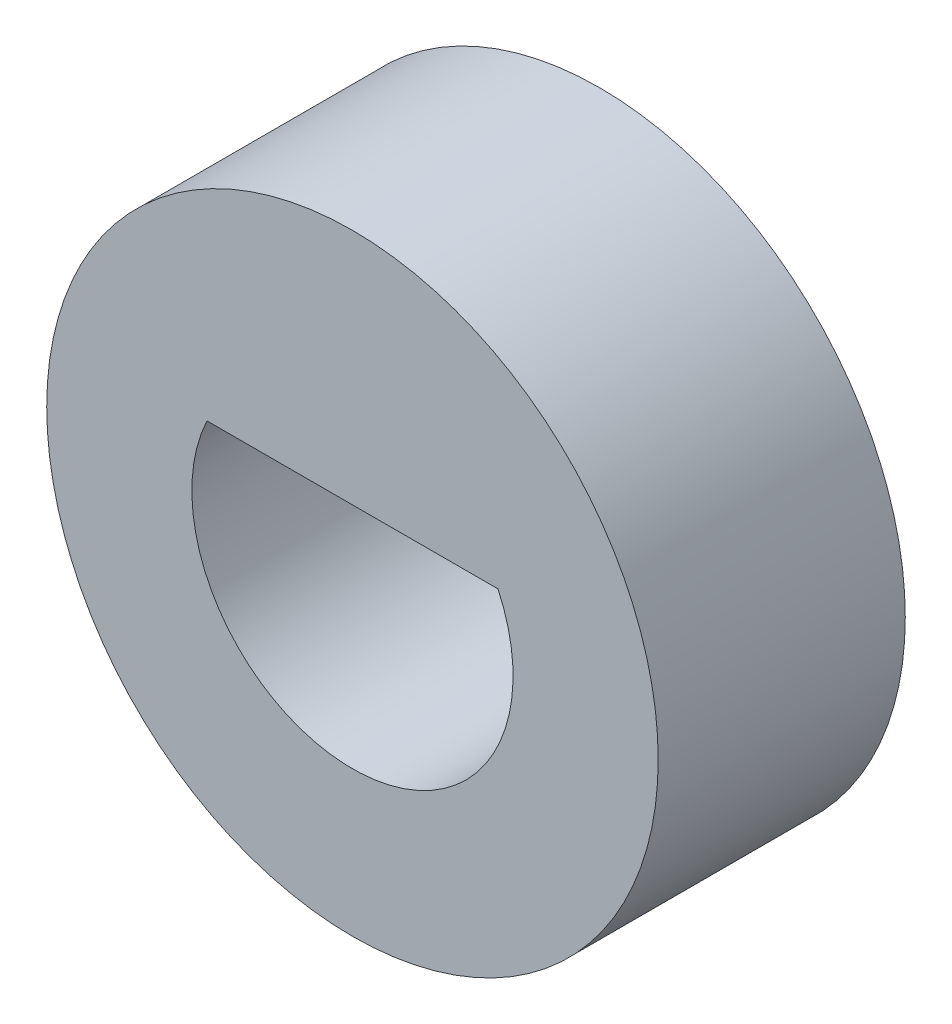
ISO-10303-21;
HEADER;
FILE_DESCRIPTION(('STEP AP214'),'2;1');
FILE_NAME('part.step','',(''),(''),'','','');
FILE_SCHEMA(('AUTOMOTIVE_DESIGN { 1 0 10303 214 1 1 1 1 }'));
ENDSEC;
DATA;
#1=APPLICATION_CONTEXT('core data for automotive mechanical design processes');
#2=APPLICATION_PROTOCOL_DEFINITION('international standard','automotive_design',2000,#1);
#3=PRODUCT_CONTEXT('',#1,'mechanical');
#4=PRODUCT('Part','Part','',(#3));
#5=PRODUCT_RELATED_PRODUCT_CATEGORY('part','',(#4));
#6=PRODUCT_DEFINITION_FORMATION('','',#4);
#7=PRODUCT_DEFINITION_CONTEXT('part definition',#1,'design');
#8=PRODUCT_DEFINITION('design','',#6,#7);
#9=PRODUCT_DEFINITION_SHAPE('','',#8);
#10=(LENGTH_UNIT() NAMED_UNIT(*) SI_UNIT(.MILLI.,.METRE.));
#11=(NAMED_UNIT(*) PLANE_ANGLE_UNIT() SI_UNIT($,.RADIAN.));
#12=(NAMED_UNIT(*) SI_UNIT($,.STERADIAN.) SOLID_ANGLE_UNIT());
#13=UNCERTAINTY_MEASURE_WITH_UNIT(LENGTH_MEASURE(1.E-05),#10,'distance_accuracy_value','');
#14=(GEOMETRIC_REPRESENTATION_CONTEXT(3) GLOBAL_UNCERTAINTY_ASSIGNED_CONTEXT((#13)) GLOBAL_UNIT_ASSIGNED_CONTEXT((#10,
#11,#12)) REPRESENTATION_CONTEXT('',''));
#15=CARTESIAN_POINT('',(0.,0.,0.));
#16=DIRECTION('',(0.,0.,1.));
#17=DIRECTION('',(1.,0.,0.));
#18=AXIS2_PLACEMENT_3D('',#15,#16,#17);
#19=CARTESIAN_POINT('',(0.,0.,4.));
#20=DIRECTION('',(0.,0.,-1.));
#21=DIRECTION('',(-1.,0.,0.));
#22=AXIS2_PLACEMENT_3D('',#19,#20,#21);
#23=CYLINDRICAL_SURFACE('',#22,2.6);
#24=CARTESIAN_POINT('',(0.,0.,0.));
#25=DIRECTION('',(0.,0.,1.));
#26=DIRECTION('',(1.,0.,0.));
#27=AXIS2_PLACEMENT_3D('',#24,#25,#26);
#28=CIRCLE('',#27,2.6);
#29=CARTESIAN_POINT('',(-2.35584379787795,1.1,0.));
#30=VERTEX_POINT('',#29);
#31=CARTESIAN_POINT('',(2.35584379787795,1.1,0.));
#32=VERTEX_POINT('',#31);
#33=EDGE_CURVE('E63',#30,#32,#28,.T.);
#34=ORIENTED_EDGE('',*,*,#33,.F.);
#35=DIRECTION('',(0.,0.,-1.));
#36=VECTOR('',#35,1.);
#37=CARTESIAN_POINT('',(-2.35584379787795,1.1,4.));
#38=LINE('',#37,#36);
#39=CARTESIAN_POINT('',(-2.35584379787795,1.1,4.));
#40=VERTEX_POINT('',#39);
#41=EDGE_CURVE('E11',#40,#30,#38,.T.);
#42=ORIENTED_EDGE('',*,*,#41,.F.);
#43=CARTESIAN_POINT('',(0.,0.,4.));
#44=DIRECTION('',(0.,0.,1.));
#45=DIRECTION('',(1.,0.,0.));
#46=AXIS2_PLACEMENT_3D('',#43,#44,#45);
#47=CIRCLE('',#46,2.6);
#48=CARTESIAN_POINT('',(2.35584379787795,1.1,4.));
#49=VERTEX_POINT('',#48);
#50=EDGE_CURVE('E64',#40,#49,#47,.T.);
#51=ORIENTED_EDGE('',*,*,#50,.T.);
#52=DIRECTION('',(0.,0.,-1.));
#53=VECTOR('',#52,1.);
#54=CARTESIAN_POINT('',(2.35584379787795,1.1,4.));
#55=LINE('',#54,#53);
#56=EDGE_CURVE('E43',#49,#32,#55,.T.);
#57=ORIENTED_EDGE('',*,*,#56,.T.);
#58=EDGE_LOOP('',(#34,#42,#51,#57));
#59=FACE_BOUND('',#58,.T.);
#60=ADVANCED_FACE('F35',(#59),#23,.F.);
#61=CARTESIAN_POINT('',(0.,1.1,4.));
#62=DIRECTION('',(0.,1.,0.));
#63=DIRECTION('',(0.,0.,1.));
#64=AXIS2_PLACEMENT_3D('',#61,#62,#63);
#65=PLANE('',#64);
#66=DIRECTION('',(1.,0.,0.));
#67=VECTOR('',#66,1.);
#68=CARTESIAN_POINT('',(0.,1.1,0.));
#69=LINE('',#68,#67);
#70=EDGE_CURVE('E66',#30,#32,#69,.T.);
#71=ORIENTED_EDGE('',*,*,#70,.T.);
#72=ORIENTED_EDGE('',*,*,#56,.F.);
#73=DIRECTION('',(1.,0.,0.));
#74=VECTOR('',#73,1.);
#75=CARTESIAN_POINT('',(0.,1.1,4.));
#76=LINE('',#75,#74);
#77=EDGE_CURVE('E50',#40,#49,#76,.T.);
#78=ORIENTED_EDGE('',*,*,#77,.F.);
#79=ORIENTED_EDGE('',*,*,#41,.T.);
#80=EDGE_LOOP('',(#71,#72,#78,#79));
#81=FACE_BOUND('',#80,.T.);
#82=ADVANCED_FACE('F67',(#81),#65,.F.);
#83=CARTESIAN_POINT('',(0.,0.,4.));
#84=DIRECTION('',(0.,0.,-1.));
#85=DIRECTION('',(-1.,0.,0.));
#86=AXIS2_PLACEMENT_3D('',#83,#84,#85);
#87=CYLINDRICAL_SURFACE('',#86,4.95);
#88=CARTESIAN_POINT('',(0.,0.,4.));
#89=DIRECTION('',(0.,0.,1.));
#90=DIRECTION('',(1.,0.,0.));
#91=AXIS2_PLACEMENT_3D('',#88,#89,#90);
#92=CIRCLE('',#91,4.95);
#93=CARTESIAN_POINT('',(4.95,0.,4.));
#94=VERTEX_POINT('',#93);
#95=EDGE_CURVE('E65',#94,#94,#92,.T.);
#96=ORIENTED_EDGE('',*,*,#95,.F.);
#97=EDGE_LOOP('',(#96));
#98=FACE_BOUND('',#97,.T.);
#99=CARTESIAN_POINT('',(0.,0.,0.));
#100=DIRECTION('',(0.,0.,1.));
#101=DIRECTION('',(1.,0.,0.));
#102=AXIS2_PLACEMENT_3D('',#99,#100,#101);
#103=CIRCLE('',#102,4.95);
#104=CARTESIAN_POINT('',(4.95,0.,0.));
#105=VERTEX_POINT('',#104);
#106=EDGE_CURVE('E69',#105,#105,#103,.T.);
#107=ORIENTED_EDGE('',*,*,#106,.T.);
#108=EDGE_LOOP('',(#107));
#109=FACE_BOUND('',#108,.T.);
#110=ADVANCED_FACE('F86',(#98,#109),#87,.T.);
#111=CARTESIAN_POINT('',(0.,0.,4.));
#112=DIRECTION('',(0.,0.,1.));
#113=DIRECTION('',(1.,0.,0.));
#114=AXIS2_PLACEMENT_3D('',#111,#112,#113);
#115=PLANE('',#114);
#116=ORIENTED_EDGE('',*,*,#50,.F.);
#117=ORIENTED_EDGE('',*,*,#77,.T.);
#118=EDGE_LOOP('',(#116,#117));
#119=FACE_BOUND('',#118,.T.);
#120=ORIENTED_EDGE('',*,*,#95,.T.);
#121=EDGE_LOOP('',(#120));
#122=FACE_BOUND('',#121,.T.);
#123=ADVANCED_FACE('F84',(#119,#122),#115,.T.);
#124=CARTESIAN_POINT('',(0.,0.,0.));
#125=DIRECTION('',(0.,0.,1.));
#126=DIRECTION('',(1.,0.,0.));
#127=AXIS2_PLACEMENT_3D('',#124,#125,#126);
#128=PLANE('',#127);
#129=ORIENTED_EDGE('',*,*,#33,.T.);
#130=ORIENTED_EDGE('',*,*,#70,.F.);
#131=EDGE_LOOP('',(#129,#130));
#132=FACE_BOUND('',#131,.T.);
#133=ORIENTED_EDGE('',*,*,#106,.F.);
#134=EDGE_LOOP('',(#133));
#135=FACE_BOUND('',#134,.T.);
#136=ADVANCED_FACE('F71',(#132,#135),#128,.F.);
#137=CLOSED_SHELL('',(#60,#82,#110,#123,#136));
#138=MANIFOLD_SOLID_BREP('B2',#137);
#139=ADVANCED_BREP_SHAPE_REPRESENTATION('',(#18,#138),#14);
#140=SHAPE_DEFINITION_REPRESENTATION(#9,#139);
ENDSEC;
END-ISO-10303-21;
